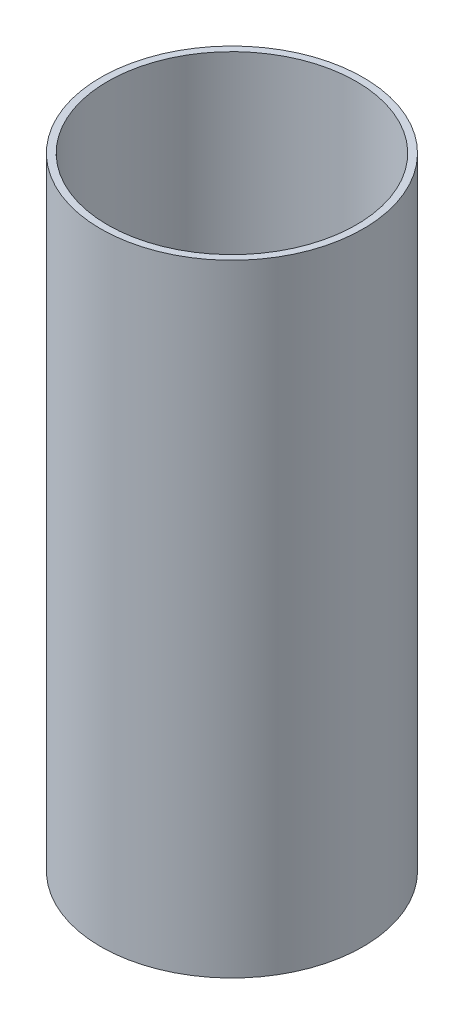
ISO-10303-21;
HEADER;
FILE_DESCRIPTION(('STEP AP214'),'2;1');
FILE_NAME('part.step','',(''),(''),'','','');
FILE_SCHEMA(('AUTOMOTIVE_DESIGN { 1 0 10303 214 1 1 1 1 }'));
ENDSEC;
DATA;
#1=APPLICATION_CONTEXT('core data for automotive mechanical design processes');
#2=APPLICATION_PROTOCOL_DEFINITION('international standard','automotive_design',2000,#1);
#3=PRODUCT_CONTEXT('',#1,'mechanical');
#4=PRODUCT('Part','Part','',(#3));
#5=PRODUCT_RELATED_PRODUCT_CATEGORY('part','',(#4));
#6=PRODUCT_DEFINITION_FORMATION('','',#4);
#7=PRODUCT_DEFINITION_CONTEXT('part definition',#1,'design');
#8=PRODUCT_DEFINITION('design','',#6,#7);
#9=PRODUCT_DEFINITION_SHAPE('','',#8);
#10=(LENGTH_UNIT() NAMED_UNIT(*) SI_UNIT(.MILLI.,.METRE.));
#11=(NAMED_UNIT(*) PLANE_ANGLE_UNIT() SI_UNIT($,.RADIAN.));
#12=(NAMED_UNIT(*) SI_UNIT($,.STERADIAN.) SOLID_ANGLE_UNIT());
#13=UNCERTAINTY_MEASURE_WITH_UNIT(LENGTH_MEASURE(1.E-05),#10,'distance_accuracy_value','');
#14=(GEOMETRIC_REPRESENTATION_CONTEXT(3) GLOBAL_UNCERTAINTY_ASSIGNED_CONTEXT((#13)) GLOBAL_UNIT_ASSIGNED_CONTEXT((#10,
#11,#12)) REPRESENTATION_CONTEXT('',''));
#15=CARTESIAN_POINT('',(0.,0.,0.));
#16=DIRECTION('',(0.,0.,1.));
#17=DIRECTION('',(1.,0.,0.));
#18=AXIS2_PLACEMENT_3D('',#15,#16,#17);
#19=CARTESIAN_POINT('',(-13.05625,3.,0.));
#20=DIRECTION('',(0.,-1.,0.));
#21=DIRECTION('',(0.,0.,-1.));
#22=AXIS2_PLACEMENT_3D('',#19,#20,#21);
#23=CYLINDRICAL_SURFACE('',#22,2.5);
#24=CARTESIAN_POINT('',(-13.05625,3.,0.));
#25=DIRECTION('',(0.,1.,0.));
#26=DIRECTION('',(0.,0.,1.));
#27=AXIS2_PLACEMENT_3D('',#24,#25,#26);
#28=CIRCLE('',#27,2.5);
#29=CARTESIAN_POINT('',(-13.05625,3.,2.5));
#30=VERTEX_POINT('',#29);
#31=EDGE_CURVE('E61',#30,#30,#28,.T.);
#32=ORIENTED_EDGE('',*,*,#31,.T.);
#33=EDGE_LOOP('',(#32));
#34=FACE_BOUND('',#33,.T.);
#35=CARTESIAN_POINT('',(-13.05625,0.,0.));
#36=DIRECTION('',(0.,1.,0.));
#37=DIRECTION('',(0.,0.,1.));
#38=AXIS2_PLACEMENT_3D('',#35,#36,#37);
#39=CIRCLE('',#38,2.5);
#40=CARTESIAN_POINT('',(-13.05625,0.,2.5));
#41=VERTEX_POINT('',#40);
#42=EDGE_CURVE('E81',#41,#41,#39,.T.);
#43=ORIENTED_EDGE('',*,*,#42,.F.);
#44=EDGE_LOOP('',(#43));
#45=FACE_BOUND('',#44,.T.);
#46=ADVANCED_FACE('F47',(#34,#45),#23,.F.);
#47=CARTESIAN_POINT('',(0.,3.,0.));
#48=DIRECTION('',(0.,-1.,0.));
#49=DIRECTION('',(0.,0.,-1.));
#50=AXIS2_PLACEMENT_3D('',#47,#48,#49);
#51=CYLINDRICAL_SURFACE('',#50,8.);
#52=CARTESIAN_POINT('',(0.,3.,0.));
#53=DIRECTION('',(0.,1.,0.));
#54=DIRECTION('',(0.,0.,1.));
#55=AXIS2_PLACEMENT_3D('',#52,#53,#54);
#56=CIRCLE('',#55,8.);
#57=CARTESIAN_POINT('',(0.,3.,8.));
#58=VERTEX_POINT('',#57);
#59=EDGE_CURVE('E67',#58,#58,#56,.T.);
#60=ORIENTED_EDGE('',*,*,#59,.T.);
#61=EDGE_LOOP('',(#60));
#62=FACE_BOUND('',#61,.T.);
#63=CARTESIAN_POINT('',(0.,0.,0.));
#64=DIRECTION('',(0.,1.,0.));
#65=DIRECTION('',(0.,0.,1.));
#66=AXIS2_PLACEMENT_3D('',#63,#64,#65);
#67=CIRCLE('',#66,8.);
#68=CARTESIAN_POINT('',(0.,0.,8.));
#69=VERTEX_POINT('',#68);
#70=EDGE_CURVE('E77',#69,#69,#67,.T.);
#71=ORIENTED_EDGE('',*,*,#70,.F.);
#72=EDGE_LOOP('',(#71));
#73=FACE_BOUND('',#72,.T.);
#74=ADVANCED_FACE('F49',(#62,#73),#51,.F.);
#75=CARTESIAN_POINT('',(0.,3.,0.));
#76=DIRECTION('',(0.,-1.,0.));
#77=DIRECTION('',(0.,0.,-1.));
#78=AXIS2_PLACEMENT_3D('',#75,#76,#77);
#79=CYLINDRICAL_SURFACE('',#78,19.);
#80=CARTESIAN_POINT('',(-19.,11.75,0.));
#81=CARTESIAN_POINT('',(-18.9999960641759,11.750006015827,-0.28902579852735));
#82=CARTESIAN_POINT('',(-18.9933406628373,11.7739472096531,-0.578114647957931));
#83=CARTESIAN_POINT('',(-18.9674382919598,11.8688939716461,-1.147939019182));
#84=CARTESIAN_POINT('',(-18.9481859108182,11.9399197673073,-1.42867089664526));
#85=CARTESIAN_POINT('',(-18.8992102793028,12.1265310931167,-1.97347572276647));
#86=CARTESIAN_POINT('',(-18.8695010851528,12.2420568252831,-2.23757047623197));
#87=CARTESIAN_POINT('',(-18.8027369867239,12.5141603273054,-2.74263822182301));
#88=CARTESIAN_POINT('',(-18.7656814517628,12.6707416221478,-2.98360922614042));
#89=CARTESIAN_POINT('',(-18.6871868942479,13.0245995145286,-3.44155081654358));
#90=CARTESIAN_POINT('',(-18.6456686707363,13.2227042274052,-3.65786793042992));
#91=CARTESIAN_POINT('',(-18.5634263251046,13.6522167991678,-4.05467053799851));
#92=CARTESIAN_POINT('',(-18.5227023141051,13.883629280812,-4.23515104966045));
#93=CARTESIAN_POINT('',(-18.4458416858151,14.3784911947125,-4.55841291724455));
#94=CARTESIAN_POINT('',(-18.4098045936143,14.6424568796192,-4.7004298242795));
#95=CARTESIAN_POINT('',(-18.3475680012894,15.1916770644697,-4.93780445501246));
#96=CARTESIAN_POINT('',(-18.3213665378996,15.4769273022146,-5.03317149152978));
#97=CARTESIAN_POINT('',(-18.2825876832386,16.0533527432415,-5.17224549953404));
#98=CARTESIAN_POINT('',(-18.2696969327651,16.3442191011171,-5.21714299132391));
#99=CARTESIAN_POINT('',(-18.258063891002,16.9296191893469,-5.2577168734259));
#100=CARTESIAN_POINT('',(-18.2593187435066,17.2241521673597,-5.25340320019572));
#101=CARTESIAN_POINT('',(-18.2755554152225,17.799127225826,-5.19661953061765));
#102=CARTESIAN_POINT('',(-18.2901226551916,18.0797265236332,-5.14560386207519));
#103=CARTESIAN_POINT('',(-18.3306770156681,18.6282189237205,-4.99919931281009));
#104=CARTESIAN_POINT('',(-18.3566651086175,18.8961109418719,-4.90380665351586));
#105=CARTESIAN_POINT('',(-18.4174879937468,19.4153097170307,-4.67020315304287));
#106=CARTESIAN_POINT('',(-18.452425005186,19.6663794307894,-4.53149321026106));
#107=CARTESIAN_POINT('',(-18.5271558963164,20.1421835303808,-4.21554036353378));
#108=CARTESIAN_POINT('',(-18.5669507942751,20.3669123754545,-4.03828937484867));
#109=CARTESIAN_POINT('',(-18.6486270393785,20.7919485869556,-3.64290902546542));
#110=CARTESIAN_POINT('',(-18.690532568895,20.9911205133784,-3.42356223456569));
#111=CARTESIAN_POINT('',(-18.770458763239,21.3500947208381,-2.95406494304309));
#112=CARTESIAN_POINT('',(-18.8084792517482,21.5098952155094,-2.70391304549923));
#113=CARTESIAN_POINT('',(-18.8766146766673,21.7861418693494,-2.17806364319182));
#114=CARTESIAN_POINT('',(-18.9066895859947,21.9023697097876,-1.90224592008153));
#115=CARTESIAN_POINT('',(-18.9552564711857,22.0864720240867,-1.33396186666635));
#116=CARTESIAN_POINT('',(-18.9737511710166,22.1543578697617,-1.04149946929357));
#117=CARTESIAN_POINT('',(-18.9966565375543,22.2380366189644,-0.457907507850037));
#118=CARTESIAN_POINT('',(-19.0014840502271,22.2553718160708,-0.167015111287478));
#119=CARTESIAN_POINT('',(-18.9977163735016,22.2417341108589,0.413525076755794));
#120=CARTESIAN_POINT('',(-18.9891226819961,22.210766599434,0.703173003509678));
#121=CARTESIAN_POINT('',(-18.9597485770797,22.1026631263448,1.26740948302397));
#122=CARTESIAN_POINT('',(-18.9391983914642,22.0263988123266,1.54217813218907));
#123=CARTESIAN_POINT('',(-18.8882535623004,21.8308889127042,2.07498632521317));
#124=CARTESIAN_POINT('',(-18.857857814072,21.7116385038557,2.33302398794088));
#125=CARTESIAN_POINT('',(-18.7896307830032,21.4307574187516,2.83095037228141));
#126=CARTESIAN_POINT('',(-18.7516589757399,21.268302792148,3.07035455519927));
#127=CARTESIAN_POINT('',(-18.6726628280168,20.9066505678317,3.51904128786068));
#128=CARTESIAN_POINT('',(-18.6316378398993,20.7074451610083,3.72831741888788));
#129=CARTESIAN_POINT('',(-18.5496062060199,20.2707311430878,4.11739039249219));
#130=CARTESIAN_POINT('',(-18.5086381336406,20.0322411487838,4.29609594559808));
#131=CARTESIAN_POINT('',(-18.4327188144802,19.5277816158304,4.6109881372173));
#132=CARTESIAN_POINT('',(-18.3977673343292,19.2618131436497,4.74717642504599));
#133=CARTESIAN_POINT('',(-18.3382454492784,18.7111755249028,4.97215298511263));
#134=CARTESIAN_POINT('',(-18.313617196103,18.4266212037232,5.06120614797422));
#135=CARTESIAN_POINT('',(-18.2775534593401,17.8457718111358,5.18995134840738));
#136=CARTESIAN_POINT('',(-18.2661142970536,17.5494800373968,5.2296571501776));
#137=CARTESIAN_POINT('',(-18.2580470145569,16.9647826638982,5.25774684044753));
#138=CARTESIAN_POINT('',(-18.2609108102196,16.6764674314495,5.24789121278311));
#139=CARTESIAN_POINT('',(-18.2799282388865,16.1057811935187,5.18125456186272));
#140=CARTESIAN_POINT('',(-18.2960814807495,15.8234100133394,5.12447491969614));
#141=CARTESIAN_POINT('',(-18.3395441670192,15.2750265147469,4.96665660211103));
#142=CARTESIAN_POINT('',(-18.3667529024701,15.008890831226,4.86601688047503));
#143=CARTESIAN_POINT('',(-18.429256924666,14.4970754390579,4.62364385356956));
#144=CARTESIAN_POINT('',(-18.4645535629639,14.2513991587051,4.48190367903643));
#145=CARTESIAN_POINT('',(-18.5406411798231,13.7791373275295,4.15612757414833));
#146=CARTESIAN_POINT('',(-18.5815699314008,13.5533939983436,3.97090277933523));
#147=CARTESIAN_POINT('',(-18.6635705112475,13.1356220296177,3.56564240864868));
#148=CARTESIAN_POINT('',(-18.7046423723875,12.9436017391346,3.34559823785164));
#149=CARTESIAN_POINT('',(-18.7834557231975,12.5942757433471,2.87071326353761));
#150=CARTESIAN_POINT('',(-18.8210963695943,12.4378910226249,2.61517673466857));
#151=CARTESIAN_POINT('',(-18.8876761749555,12.1705421950256,2.08040347331053));
#152=CARTESIAN_POINT('',(-18.9166205062739,12.0595510749042,1.80118095590995));
#153=CARTESIAN_POINT('',(-18.959135706199,11.8993794541691,1.26946355768817));
#154=CARTESIAN_POINT('',(-18.9743441119523,11.8434980347719,1.01909851226516));
#155=CARTESIAN_POINT('',(-18.9947774282908,11.7688077776363,0.512505049013734));
#156=CARTESIAN_POINT('',(-19.0000034898698,11.749994665805,0.256277310619161));
#157=CARTESIAN_POINT('',(-19.,11.75,0.));
#158=B_SPLINE_CURVE_WITH_KNOTS('',3,(#80,#81,#82,#83,#84,#85,#86,#87,#88,#89,#90,#91,#92,#93,
#94,#95,#96,#97,#98,#99,#100,#101,#102,#103,#104,#105,#106,#107,#108,#109,#110,#111,#112,#113,
#114,#115,#116,#117,#118,#119,#120,#121,#122,#123,#124,#125,#126,#127,#128,#129,#130,#131,#132,
#133,#134,#135,#136,#137,#138,#139,#140,#141,#142,#143,#144,#145,#146,#147,#148,#149,#150,#151,
#152,#153,#154,#155,#156,#157),.UNSPECIFIED.,.T.,.F.,(4,2,2,2,2,2,2,2,2,2,2,2,2,2,2,2,2,2,2,2,2,
2,2,2,2,2,2,2,2,2,2,2,2,2,2,2,2,2,4),(0.,0.866137141439229,1.73264661580347,2.59799573418845,
3.46341917486098,4.34810245375522,5.23290863573365,6.13418825991123,7.03528788609229,
7.91465372390725,8.79384200797458,9.64655012284273,10.4993308566179,11.3623243390556,
12.2254990262341,13.1190007278463,14.0125429620636,14.910504238599,15.8082542117933,
16.6783116942179,17.5482720795692,18.4020107397007,19.2558452232072,20.1273033849394,
20.9989469350609,21.8971238517712,22.7952659223759,23.6883055216684,24.5810959742012,
25.4424022541787,26.3036831846926,27.1572882344613,28.0110360325639,28.891605007659,
29.7723916852033,30.6738597039964,31.5747904855392,32.3428772681282,33.1108754827043),.UNSPECIFIED.);
#159=CARTESIAN_POINT('',(-19.,11.75,0.));
#160=VERTEX_POINT('',#159);
#161=EDGE_CURVE('E119',#160,#160,#158,.T.);
#162=ORIENTED_EDGE('',*,*,#161,.T.);
#163=EDGE_LOOP('',(#162));
#164=FACE_BOUND('',#163,.T.);
#165=CARTESIAN_POINT('',(0.,0.,0.));
#166=DIRECTION('',(0.,1.,0.));
#167=DIRECTION('',(0.,0.,1.));
#168=AXIS2_PLACEMENT_3D('',#165,#166,#167);
#169=CIRCLE('',#168,19.);
#170=CARTESIAN_POINT('',(0.,0.,19.));
#171=VERTEX_POINT('',#170);
#172=EDGE_CURVE('E75',#171,#171,#169,.T.);
#173=ORIENTED_EDGE('',*,*,#172,.T.);
#174=EDGE_LOOP('',(#173));
#175=FACE_BOUND('',#174,.T.);
#176=CARTESIAN_POINT('',(0.,90.,0.));
#177=DIRECTION('',(0.,1.,0.));
#178=DIRECTION('',(0.,0.,1.));
#179=AXIS2_PLACEMENT_3D('',#176,#177,#178);
#180=CIRCLE('',#179,19.);
#181=CARTESIAN_POINT('',(0.,90.,19.));
#182=VERTEX_POINT('',#181);
#183=EDGE_CURVE('E71',#182,#182,#180,.T.);
#184=ORIENTED_EDGE('',*,*,#183,.F.);
#185=EDGE_LOOP('',(#184));
#186=FACE_BOUND('',#185,.T.);
#187=ADVANCED_FACE('F88',(#164,#175,#186),#79,.T.);
#188=CARTESIAN_POINT('',(0.,3.,0.));
#189=DIRECTION('',(0.,1.,0.));
#190=DIRECTION('',(0.,0.,1.));
#191=AXIS2_PLACEMENT_3D('',#188,#189,#190);
#192=PLANE('',#191);
#193=CARTESIAN_POINT('',(0.,3.,0.));
#194=DIRECTION('',(0.,1.,0.));
#195=DIRECTION('',(0.,0.,1.));
#196=AXIS2_PLACEMENT_3D('',#193,#194,#195);
#197=CIRCLE('',#196,18.);
#198=CARTESIAN_POINT('',(0.,3.,18.));
#199=VERTEX_POINT('',#198);
#200=EDGE_CURVE('E10',#199,#199,#197,.F.);
#201=ORIENTED_EDGE('',*,*,#200,.F.);
#202=EDGE_LOOP('',(#201));
#203=FACE_BOUND('',#202,.T.);
#204=ORIENTED_EDGE('',*,*,#59,.F.);
#205=EDGE_LOOP('',(#204));
#206=FACE_BOUND('',#205,.T.);
#207=ORIENTED_EDGE('',*,*,#31,.F.);
#208=EDGE_LOOP('',(#207));
#209=FACE_BOUND('',#208,.T.);
#210=ADVANCED_FACE('F94',(#203,#206,#209),#192,.T.);
#211=CARTESIAN_POINT('',(0.,0.,0.));
#212=DIRECTION('',(0.,1.,0.));
#213=DIRECTION('',(0.,0.,1.));
#214=AXIS2_PLACEMENT_3D('',#211,#212,#213);
#215=PLANE('',#214);
#216=ORIENTED_EDGE('',*,*,#70,.T.);
#217=EDGE_LOOP('',(#216));
#218=FACE_BOUND('',#217,.T.);
#219=ORIENTED_EDGE('',*,*,#42,.T.);
#220=EDGE_LOOP('',(#219));
#221=FACE_BOUND('',#220,.T.);
#222=ORIENTED_EDGE('',*,*,#172,.F.);
#223=EDGE_LOOP('',(#222));
#224=FACE_BOUND('',#223,.T.);
#225=ADVANCED_FACE('F91',(#218,#221,#224),#215,.F.);
#226=CARTESIAN_POINT('',(0.,90.,0.));
#227=DIRECTION('',(0.,-1.,0.));
#228=DIRECTION('',(0.,0.,-1.));
#229=AXIS2_PLACEMENT_3D('',#226,#227,#228);
#230=CYLINDRICAL_SURFACE('',#229,18.);
#231=CARTESIAN_POINT('',(-17.2173604248735,17.,-5.25));
#232=CARTESIAN_POINT('',(-17.2173640570326,17.2880814798699,-5.24999544429934));
#233=CARTESIAN_POINT('',(-17.2246698205327,17.5762084833441,-5.22620760605858));
#234=CARTESIAN_POINT('',(-17.2529945777607,18.144065466411,-5.13191276316762));
#235=CARTESIAN_POINT('',(-17.2740187356879,18.4237922422966,-5.06138816461484));
#236=CARTESIAN_POINT('',(-17.327200993125,18.9665479482205,-4.87619673056514));
#237=CARTESIAN_POINT('',(-17.3593413210009,19.2296027425542,-4.76160032097623));
#238=CARTESIAN_POINT('',(-17.4311108378804,19.732812136867,-4.49174710440748));
#239=CARTESIAN_POINT('',(-17.4707410124993,19.9729637166665,-4.33648494504002));
#240=CARTESIAN_POINT('',(-17.5543541400089,20.4307329217009,-3.98473662988137));
#241=CARTESIAN_POINT('',(-17.5984259100004,20.6475641258349,-3.78724790105667));
#242=CARTESIAN_POINT('',(-17.6851957385958,21.0455468609265,-3.35880299076715));
#243=CARTESIAN_POINT('',(-17.7278936294737,21.2266940492281,-3.12784274183051));
#244=CARTESIAN_POINT('',(-17.8081090862169,21.5515461429357,-2.63345314791107));
#245=CARTESIAN_POINT('',(-17.8455097630812,21.6944544043264,-2.36947972407777));
#246=CARTESIAN_POINT('',(-17.9098881958383,21.9335507446381,-1.81997332750443));
#247=CARTESIAN_POINT('',(-17.9368680703095,22.0297483209966,-1.53444475111347));
#248=CARTESIAN_POINT('',(-17.9767366763872,22.1701050204457,-0.95815597924697));
#249=CARTESIAN_POINT('',(-17.989987892723,22.2156053279615,-0.667747959571927));
#250=CARTESIAN_POINT('',(-18.0021802856239,22.2575112170697,-0.0831380829370387));
#251=CARTESIAN_POINT('',(-18.0011243086142,22.2539265641451,0.211063007753116));
#252=CARTESIAN_POINT('',(-17.9850799702649,22.1986760746376,0.785518017030612));
#253=CARTESIAN_POINT('',(-17.9705122147692,22.1484617106435,1.06592511978057));
#254=CARTESIAN_POINT('',(-17.9295884466048,22.003741374617,1.61414437895112));
#255=CARTESIAN_POINT('',(-17.9032317039946,21.9092326599835,1.88195575434415));
#256=CARTESIAN_POINT('',(-17.8410989987857,21.6775904759198,2.40089757368069));
#257=CARTESIAN_POINT('',(-17.8052205347205,21.5399900310801,2.65180679402427));
#258=CARTESIAN_POINT('',(-17.7278659786384,21.2264366716694,3.12744600226536));
#259=CARTESIAN_POINT('',(-17.6863886184539,21.0504750626041,3.35217003758727));
#260=CARTESIAN_POINT('',(-17.6005023201417,20.6576190028211,3.77772425822363));
#261=CARTESIAN_POINT('',(-17.5560416393621,20.439464427433,3.97738221073768));
#262=CARTESIAN_POINT('',(-17.4705350430842,19.9723273710016,4.3375998057416));
#263=CARTESIAN_POINT('',(-17.4294894296361,19.723342167938,4.49815599223851));
#264=CARTESIAN_POINT('',(-17.3552225801157,19.1986688420816,4.77674635590089));
#265=CARTESIAN_POINT('',(-17.322071891324,18.9227689061413,4.89440179112013));
#266=CARTESIAN_POINT('',(-17.2681935074842,18.3538849457373,5.08124553484268));
#267=CARTESIAN_POINT('',(-17.2474620195423,18.0609061672744,5.15044864205072));
#268=CARTESIAN_POINT('',(-17.2215955780578,17.4772882484495,5.23627701661527));
#269=CARTESIAN_POINT('',(-17.2159348484796,17.1869329636423,5.2546755973361));
#270=CARTESIAN_POINT('',(-17.2194008947687,16.6072813273927,5.2433076493615));
#271=CARTESIAN_POINT('',(-17.2285257346041,16.3179848422816,5.21354742661135));
#272=CARTESIAN_POINT('',(-17.2600207985972,15.7559095042502,5.10828205539594));
#273=CARTESIAN_POINT('',(-17.2820658714115,15.4829004833807,5.03389884341193));
#274=CARTESIAN_POINT('',(-17.3365855704956,14.9532494097933,4.84278948948732));
#275=CARTESIAN_POINT('',(-17.3690617457426,14.6966097946553,4.72605705852282));
#276=CARTESIAN_POINT('',(-17.4418193547531,14.1997164379715,4.45013856389731));
#277=CARTESIAN_POINT('',(-17.4822794117697,13.9600508095128,4.28994164133419));
#278=CARTESIAN_POINT('',(-17.5660530477212,13.5103543924184,3.93285543683467));
#279=CARTESIAN_POINT('',(-17.6093672702706,13.3003303217342,3.73595786046632));
#280=CARTESIAN_POINT('',(-17.6958242022226,12.9082260457159,3.30275703828593));
#281=CARTESIAN_POINT('',(-17.7389065874467,12.7273978894687,3.0653057886106));
#282=CARTESIAN_POINT('',(-17.818494363032,12.4081358359723,2.56241467972018));
#283=CARTESIAN_POINT('',(-17.8550000913977,12.2696997597435,2.29697626000632));
#284=CARTESIAN_POINT('',(-17.9170921663908,12.0404816454499,1.74745463737071));
#285=CARTESIAN_POINT('',(-17.9427606330888,11.9493399770133,1.46353118776611));
#286=CARTESIAN_POINT('',(-17.980648832619,11.816337984124,0.883520672370999));
#287=CARTESIAN_POINT('',(-17.992872183724,11.7744644007142,0.587436901357373));
#288=CARTESIAN_POINT('',(-18.0022853482133,11.7421502727517,0.00311231885899541));
#289=CARTESIAN_POINT('',(-18.0000073760467,11.7498889784774,-0.285020522193463));
#290=CARTESIAN_POINT('',(-17.9819150348654,11.8122596917109,-0.855707148042807));
#291=CARTESIAN_POINT('',(-17.9661013622401,11.8668892867605,-1.13826121909307));
#292=CARTESIAN_POINT('',(-17.922854782735,12.0203873071386,-1.68712943968577));
#293=CARTESIAN_POINT('',(-17.8955356084277,12.1188232301907,-1.95357411382507));
#294=CARTESIAN_POINT('',(-17.8321094699264,12.3567543297251,-2.46631018258663));
#295=CARTESIAN_POINT('',(-17.7960011091408,12.4962560322501,-2.71259836604729));
#296=CARTESIAN_POINT('',(-17.7174297990725,12.8173296444937,-3.18623889551061));
#297=CARTESIAN_POINT('',(-17.6748058551453,13.0000611492048,-3.41277827642957));
#298=CARTESIAN_POINT('',(-17.5885554916028,13.400290606746,-3.83258897324842));
#299=CARTESIAN_POINT('',(-17.5449287932232,13.6177983298998,-4.02585090811663));
#300=CARTESIAN_POINT('',(-17.4601970408072,14.0886438676298,-4.37898068015797));
#301=CARTESIAN_POINT('',(-17.4191953439829,14.3428074447298,-4.53777491521178));
#302=CARTESIAN_POINT('',(-17.3459554187194,14.8753824601892,-4.81018166947065));
#303=CARTESIAN_POINT('',(-17.3137125692323,15.1537810097315,-4.92381802805842));
#304=CARTESIAN_POINT('',(-17.2651721604358,15.6917814504244,-5.09121379521171));
#305=CARTESIAN_POINT('',(-17.2474055709008,15.9495108138563,-5.15060118809081));
#306=CARTESIAN_POINT('',(-17.2234990511772,16.4714814437453,-5.22999294511083));
#307=CARTESIAN_POINT('',(-17.2173570928255,16.7357215661114,-5.25000417928094));
#308=CARTESIAN_POINT('',(-17.2173604248735,17.,-5.25));
#309=B_SPLINE_CURVE_WITH_KNOTS('',3,(#231,#232,#233,#234,#235,#236,#237,#238,#239,#240,#241,
#242,#243,#244,#245,#246,#247,#248,#249,#250,#251,#252,#253,#254,#255,#256,#257,#258,#259,#260,
#261,#262,#263,#264,#265,#266,#267,#268,#269,#270,#271,#272,#273,#274,#275,#276,#277,#278,#279,
#280,#281,#282,#283,#284,#285,#286,#287,#288,#289,#290,#291,#292,#293,#294,#295,#296,#297,#298,
#299,#300,#301,#302,#303,#304,#305,#306,#307,#308),.UNSPECIFIED.,.T.,.F.,(4,2,2,2,2,2,2,2,2,2,2,
2,2,2,2,2,2,2,2,2,2,2,2,2,2,2,2,2,2,2,2,2,2,2,2,2,2,2,4),(0.,0.863270391667566,1.72686594343009,
2.58908718198539,3.45142196236537,4.33711100364687,5.22290776458582,6.12593054831269,
7.02876964820941,7.9071111335605,8.78527787487402,9.63699395595853,10.4887627802517,
11.3501015569044,12.2116357578961,13.1046313201257,13.997705780768,14.8984839105601,
15.7989867971978,16.6676349154818,17.5361693016155,18.3837315332543,19.2314196827411,
20.1008213768047,20.9704197964095,21.8707947382709,22.7711233925245,23.6645016724414,
24.5576394726337,25.4181919610341,26.2787001780955,27.1308947956179,27.9832249143655,
28.8617093219106,29.7404409733592,30.6435194224715,31.5461204903189,32.3382004336838,
33.1301421691794),.UNSPECIFIED.);
#310=CARTESIAN_POINT('',(-17.2173604248735,17.,-5.25));
#311=VERTEX_POINT('',#310);
#312=EDGE_CURVE('E51',#311,#311,#309,.T.);
#313=ORIENTED_EDGE('',*,*,#312,.F.);
#314=EDGE_LOOP('',(#313));
#315=FACE_BOUND('',#314,.T.);
#316=ORIENTED_EDGE('',*,*,#200,.T.);
#317=EDGE_LOOP('',(#316));
#318=FACE_BOUND('',#317,.T.);
#319=CARTESIAN_POINT('',(0.,90.,0.));
#320=DIRECTION('',(0.,1.,0.));
#321=DIRECTION('',(0.,0.,1.));
#322=AXIS2_PLACEMENT_3D('',#319,#320,#321);
#323=CIRCLE('',#322,18.);
#324=CARTESIAN_POINT('',(0.,90.,18.));
#325=VERTEX_POINT('',#324);
#326=EDGE_CURVE('E125',#325,#325,#323,.T.);
#327=ORIENTED_EDGE('',*,*,#326,.T.);
#328=EDGE_LOOP('',(#327));
#329=FACE_BOUND('',#328,.T.);
#330=ADVANCED_FACE('F93',(#315,#318,#329),#230,.F.);
#331=CARTESIAN_POINT('',(0.,90.,0.));
#332=DIRECTION('',(0.,1.,0.));
#333=DIRECTION('',(0.,0.,1.));
#334=AXIS2_PLACEMENT_3D('',#331,#332,#333);
#335=PLANE('',#334);
#336=ORIENTED_EDGE('',*,*,#326,.F.);
#337=EDGE_LOOP('',(#336));
#338=FACE_BOUND('',#337,.T.);
#339=ORIENTED_EDGE('',*,*,#183,.T.);
#340=EDGE_LOOP('',(#339));
#341=FACE_BOUND('',#340,.T.);
#342=ADVANCED_FACE('F102',(#338,#341),#335,.T.);
#343=CARTESIAN_POINT('',(-19.,17.,0.));
#344=DIRECTION('',(1.,0.,0.));
#345=DIRECTION('',(0.,0.,-1.));
#346=AXIS2_PLACEMENT_3D('',#343,#344,#345);
#347=CYLINDRICAL_SURFACE('',#346,5.25);
#348=ORIENTED_EDGE('',*,*,#312,.T.);
#349=EDGE_LOOP('',(#348));
#350=FACE_BOUND('',#349,.T.);
#351=ORIENTED_EDGE('',*,*,#161,.F.);
#352=EDGE_LOOP('',(#351));
#353=FACE_BOUND('',#352,.T.);
#354=ADVANCED_FACE('F126',(#350,#353),#347,.F.);
#355=CLOSED_SHELL('',(#46,#74,#187,#210,#225,#330,#342,#354));
#356=MANIFOLD_SOLID_BREP('B2',#355);
#357=ADVANCED_BREP_SHAPE_REPRESENTATION('',(#18,#356),#14);
#358=SHAPE_DEFINITION_REPRESENTATION(#9,#357);
ENDSEC;
END-ISO-10303-21;
